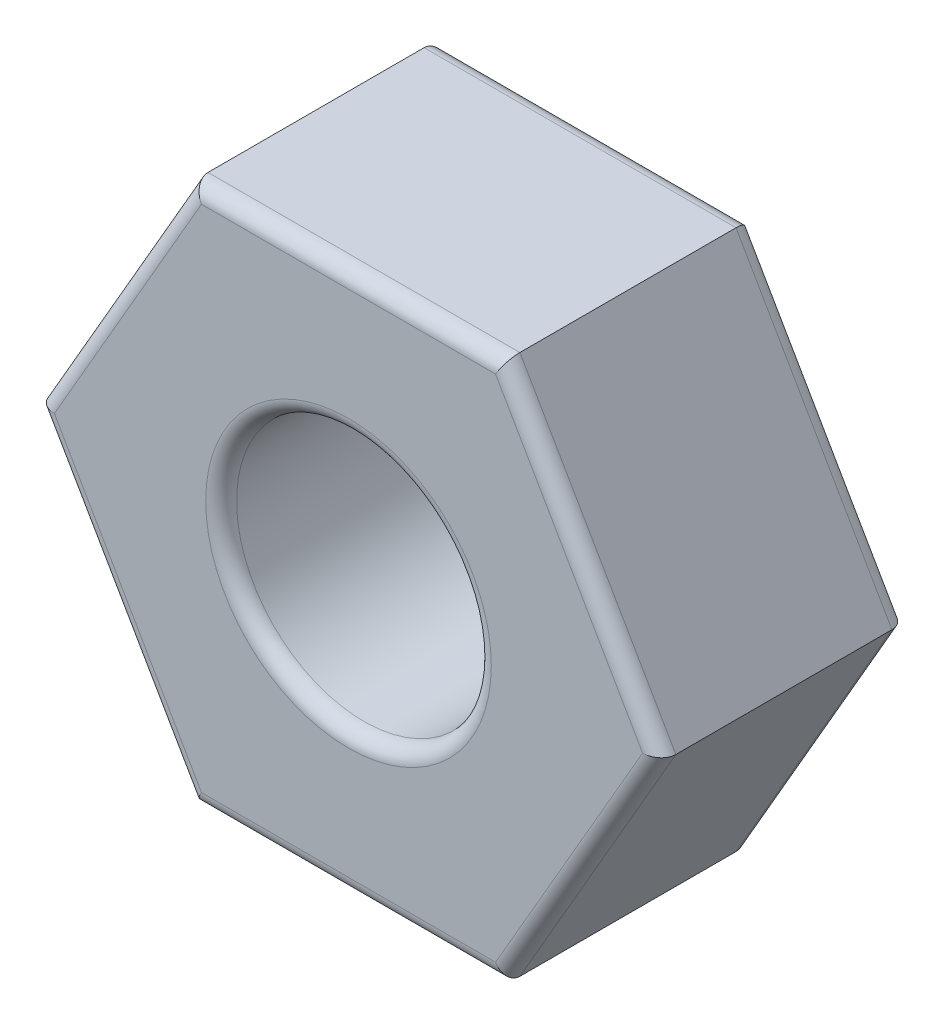
ISO-10303-21;
HEADER;
FILE_DESCRIPTION(('STEP AP214'),'2;1');
FILE_NAME('part.step','',(''),(''),'','','');
FILE_SCHEMA(('AUTOMOTIVE_DESIGN { 1 0 10303 214 1 1 1 1 }'));
ENDSEC;
DATA;
#1=APPLICATION_CONTEXT('core data for automotive mechanical design processes');
#2=APPLICATION_PROTOCOL_DEFINITION('international standard','automotive_design',2000,#1);
#3=PRODUCT_CONTEXT('',#1,'mechanical');
#4=PRODUCT('Part','Part','',(#3));
#5=PRODUCT_RELATED_PRODUCT_CATEGORY('part','',(#4));
#6=PRODUCT_DEFINITION_FORMATION('','',#4);
#7=PRODUCT_DEFINITION_CONTEXT('part definition',#1,'design');
#8=PRODUCT_DEFINITION('design','',#6,#7);
#9=PRODUCT_DEFINITION_SHAPE('','',#8);
#10=(LENGTH_UNIT() NAMED_UNIT(*) SI_UNIT(.MILLI.,.METRE.));
#11=(NAMED_UNIT(*) PLANE_ANGLE_UNIT() SI_UNIT($,.RADIAN.));
#12=(NAMED_UNIT(*) SI_UNIT($,.STERADIAN.) SOLID_ANGLE_UNIT());
#13=UNCERTAINTY_MEASURE_WITH_UNIT(LENGTH_MEASURE(1.E-05),#10,'distance_accuracy_value','');
#14=(GEOMETRIC_REPRESENTATION_CONTEXT(3) GLOBAL_UNCERTAINTY_ASSIGNED_CONTEXT((#13)) GLOBAL_UNIT_ASSIGNED_CONTEXT((#10,
#11,#12)) REPRESENTATION_CONTEXT('',''));
#15=CARTESIAN_POINT('',(0.,0.,0.));
#16=DIRECTION('',(0.,0.,1.));
#17=DIRECTION('',(1.,0.,0.));
#18=AXIS2_PLACEMENT_3D('',#15,#16,#17);
#19=CARTESIAN_POINT('',(0.,0.,3.2));
#20=DIRECTION('',(0.,0.,1.));
#21=DIRECTION('',(1.,0.,0.));
#22=AXIS2_PLACEMENT_3D('',#19,#20,#21);
#23=PLANE('',#22);
#24=CARTESIAN_POINT('',(0.,0.,3.2));
#25=DIRECTION('',(0.,0.,1.));
#26=DIRECTION('',(1.,0.,0.));
#27=AXIS2_PLACEMENT_3D('',#24,#25,#26);
#28=CIRCLE('',#27,1.85);
#29=CARTESIAN_POINT('',(1.85,0.,3.2));
#30=VERTEX_POINT('',#29);
#31=EDGE_CURVE('E11',#30,#30,#28,.F.);
#32=ORIENTED_EDGE('',*,*,#31,.T.);
#33=EDGE_LOOP('',(#32));
#34=FACE_BOUND('',#33,.T.);
#35=DIRECTION('',(0.5,-0.866025403784438,0.));
#36=VECTOR('',#35,1.);
#37=CARTESIAN_POINT('',(-1.8475208614068,-3.4,3.2));
#38=LINE('',#37,#36);
#39=CARTESIAN_POINT('',(-3.81051177665153,0.,3.2));
#40=VERTEX_POINT('',#39);
#41=CARTESIAN_POINT('',(-1.90525588832577,-3.3,3.2));
#42=VERTEX_POINT('',#41);
#43=EDGE_CURVE('E61',#40,#42,#38,.T.);
#44=ORIENTED_EDGE('',*,*,#43,.T.);
#45=DIRECTION('',(1.,0.,0.));
#46=VECTOR('',#45,1.);
#47=CARTESIAN_POINT('',(2.02072594216369,-3.3,3.2));
#48=LINE('',#47,#46);
#49=CARTESIAN_POINT('',(1.90525588832577,-3.3,3.2));
#50=VERTEX_POINT('',#49);
#51=EDGE_CURVE('E53',#42,#50,#48,.T.);
#52=ORIENTED_EDGE('',*,*,#51,.T.);
#53=DIRECTION('',(0.499999999999999,0.866025403784439,0.));
#54=VECTOR('',#53,1.);
#55=CARTESIAN_POINT('',(3.86824680357049,0.100000000000002,3.2));
#56=LINE('',#55,#54);
#57=CARTESIAN_POINT('',(3.81051177665153,0.,3.2));
#58=VERTEX_POINT('',#57);
#59=EDGE_CURVE('E221',#50,#58,#56,.T.);
#60=ORIENTED_EDGE('',*,*,#59,.T.);
#61=DIRECTION('',(-0.5,0.866025403784439,0.));
#62=VECTOR('',#61,1.);
#63=CARTESIAN_POINT('',(1.8475208614068,3.4,3.2));
#64=LINE('',#63,#62);
#65=CARTESIAN_POINT('',(1.90525588832576,3.3,3.2));
#66=VERTEX_POINT('',#65);
#67=EDGE_CURVE('E224',#58,#66,#64,.T.);
#68=ORIENTED_EDGE('',*,*,#67,.T.);
#69=DIRECTION('',(-1.,0.,0.));
#70=VECTOR('',#69,1.);
#71=CARTESIAN_POINT('',(-2.02072594216369,3.3,3.2));
#72=LINE('',#71,#70);
#73=CARTESIAN_POINT('',(-1.90525588832577,3.3,3.2));
#74=VERTEX_POINT('',#73);
#75=EDGE_CURVE('E227',#66,#74,#72,.T.);
#76=ORIENTED_EDGE('',*,*,#75,.T.);
#77=DIRECTION('',(-0.5,-0.866025403784439,0.));
#78=VECTOR('',#77,1.);
#79=CARTESIAN_POINT('',(-3.86824680357049,-0.100000000000002,3.2));
#80=LINE('',#79,#78);
#81=EDGE_CURVE('E66',#74,#40,#80,.T.);
#82=ORIENTED_EDGE('',*,*,#81,.T.);
#83=EDGE_LOOP('',(#44,#52,#60,#68,#76,#82));
#84=FACE_BOUND('',#83,.T.);
#85=ADVANCED_FACE('F43',(#34,#84),#23,.T.);
#86=CARTESIAN_POINT('',(0.,0.,0.));
#87=DIRECTION('',(0.,0.,1.));
#88=DIRECTION('',(1.,0.,0.));
#89=AXIS2_PLACEMENT_3D('',#86,#87,#88);
#90=PLANE('',#89);
#91=CARTESIAN_POINT('',(0.,0.,0.));
#92=DIRECTION('',(0.,0.,1.));
#93=DIRECTION('',(1.,0.,0.));
#94=AXIS2_PLACEMENT_3D('',#91,#92,#93);
#95=CIRCLE('',#94,1.85);
#96=CARTESIAN_POINT('',(1.85,0.,0.));
#97=VERTEX_POINT('',#96);
#98=EDGE_CURVE('E173',#97,#97,#95,.T.);
#99=ORIENTED_EDGE('',*,*,#98,.T.);
#100=EDGE_LOOP('',(#99));
#101=FACE_BOUND('',#100,.T.);
#102=DIRECTION('',(-1.,0.,0.));
#103=VECTOR('',#102,1.);
#104=CARTESIAN_POINT('',(0.,3.3,0.));
#105=LINE('',#104,#103);
#106=CARTESIAN_POINT('',(-1.90525588832577,3.3,0.));
#107=VERTEX_POINT('',#106);
#108=CARTESIAN_POINT('',(1.90525588832576,3.3,0.));
#109=VERTEX_POINT('',#108);
#110=EDGE_CURVE('E171',#107,#109,#105,.F.);
#111=ORIENTED_EDGE('',*,*,#110,.T.);
#112=DIRECTION('',(-0.5,0.866025403784439,0.));
#113=VECTOR('',#112,1.);
#114=CARTESIAN_POINT('',(2.85788383248865,1.65,0.));
#115=LINE('',#114,#113);
#116=CARTESIAN_POINT('',(3.81051177665153,0.,0.));
#117=VERTEX_POINT('',#116);
#118=EDGE_CURVE('E148',#109,#117,#115,.F.);
#119=ORIENTED_EDGE('',*,*,#118,.T.);
#120=DIRECTION('',(0.499999999999999,0.866025403784439,0.));
#121=VECTOR('',#120,1.);
#122=CARTESIAN_POINT('',(2.85788383248865,-1.65,0.));
#123=LINE('',#122,#121);
#124=CARTESIAN_POINT('',(1.90525588832577,-3.3,0.));
#125=VERTEX_POINT('',#124);
#126=EDGE_CURVE('E159',#117,#125,#123,.F.);
#127=ORIENTED_EDGE('',*,*,#126,.T.);
#128=DIRECTION('',(1.,0.,0.));
#129=VECTOR('',#128,1.);
#130=CARTESIAN_POINT('',(0.,-3.3,0.));
#131=LINE('',#130,#129);
#132=CARTESIAN_POINT('',(-1.90525588832577,-3.3,0.));
#133=VERTEX_POINT('',#132);
#134=EDGE_CURVE('E166',#125,#133,#131,.F.);
#135=ORIENTED_EDGE('',*,*,#134,.T.);
#136=DIRECTION('',(0.5,-0.866025403784438,0.));
#137=VECTOR('',#136,1.);
#138=CARTESIAN_POINT('',(-2.85788383248865,-1.65,0.));
#139=LINE('',#138,#137);
#140=CARTESIAN_POINT('',(-3.81051177665153,0.,0.));
#141=VERTEX_POINT('',#140);
#142=EDGE_CURVE('E290',#133,#141,#139,.F.);
#143=ORIENTED_EDGE('',*,*,#142,.T.);
#144=DIRECTION('',(-0.5,-0.866025403784439,0.));
#145=VECTOR('',#144,1.);
#146=CARTESIAN_POINT('',(-2.85788383248865,1.65,0.));
#147=LINE('',#146,#145);
#148=EDGE_CURVE('E179',#141,#107,#147,.F.);
#149=ORIENTED_EDGE('',*,*,#148,.T.);
#150=EDGE_LOOP('',(#111,#119,#127,#135,#143,#149));
#151=FACE_BOUND('',#150,.T.);
#152=ADVANCED_FACE('F169',(#101,#151),#90,.F.);
#153=CARTESIAN_POINT('',(2.02072594216369,-3.5,3.2));
#154=DIRECTION('',(-0.866025403784439,0.499999999999999,0.));
#155=DIRECTION('',(-0.499999999999999,-0.866025403784439,0.));
#156=AXIS2_PLACEMENT_3D('',#153,#154,#155);
#157=PLANE('',#156);
#158=DIRECTION('',(0.,0.,-1.));
#159=VECTOR('',#158,1.);
#160=CARTESIAN_POINT('',(2.02072594216369,-3.5,3.2));
#161=LINE('',#160,#159);
#162=CARTESIAN_POINT('',(2.02072594216369,-3.5,3.));
#163=VERTEX_POINT('',#162);
#164=CARTESIAN_POINT('',(2.02072594216369,-3.5,0.2));
#165=VERTEX_POINT('',#164);
#166=EDGE_CURVE('E244',#163,#165,#161,.T.);
#167=ORIENTED_EDGE('',*,*,#166,.T.);
#168=DIRECTION('',(0.499999999999999,0.866025403784439,0.));
#169=VECTOR('',#168,1.);
#170=CARTESIAN_POINT('',(2.02072594216369,-3.5,0.2));
#171=LINE('',#170,#169);
#172=CARTESIAN_POINT('',(4.04145188432738,0.,0.2));
#173=VERTEX_POINT('',#172);
#174=EDGE_CURVE('E218',#165,#173,#171,.T.);
#175=ORIENTED_EDGE('',*,*,#174,.T.);
#176=DIRECTION('',(0.,0.,-1.));
#177=VECTOR('',#176,1.);
#178=CARTESIAN_POINT('',(4.04145188432738,0.,3.2));
#179=LINE('',#178,#177);
#180=CARTESIAN_POINT('',(4.04145188432738,0.,3.));
#181=VERTEX_POINT('',#180);
#182=EDGE_CURVE('E167',#181,#173,#179,.T.);
#183=ORIENTED_EDGE('',*,*,#182,.F.);
#184=DIRECTION('',(0.499999999999999,0.866025403784439,0.));
#185=VECTOR('',#184,1.);
#186=CARTESIAN_POINT('',(2.02072594216369,-3.5,3.));
#187=LINE('',#186,#185);
#188=EDGE_CURVE('E215',#181,#163,#187,.F.);
#189=ORIENTED_EDGE('',*,*,#188,.T.);
#190=EDGE_LOOP('',(#167,#175,#183,#189));
#191=FACE_BOUND('',#190,.T.);
#192=ADVANCED_FACE('F318',(#191),#157,.F.);
#193=CARTESIAN_POINT('',(4.04145188432738,0.,3.2));
#194=DIRECTION('',(-0.866025403784438,-0.5,0.));
#195=DIRECTION('',(0.5,-0.866025403784439,0.));
#196=AXIS2_PLACEMENT_3D('',#193,#194,#195);
#197=PLANE('',#196);
#198=ORIENTED_EDGE('',*,*,#182,.T.);
#199=DIRECTION('',(-0.5,0.866025403784439,0.));
#200=VECTOR('',#199,1.);
#201=CARTESIAN_POINT('',(4.04145188432738,0.,0.2));
#202=LINE('',#201,#200);
#203=CARTESIAN_POINT('',(2.02072594216369,3.5,0.2));
#204=VERTEX_POINT('',#203);
#205=EDGE_CURVE('E151',#173,#204,#202,.T.);
#206=ORIENTED_EDGE('',*,*,#205,.T.);
#207=DIRECTION('',(0.,0.,-1.));
#208=VECTOR('',#207,1.);
#209=CARTESIAN_POINT('',(2.02072594216369,3.5,3.2));
#210=LINE('',#209,#208);
#211=CARTESIAN_POINT('',(2.02072594216369,3.5,3.));
#212=VERTEX_POINT('',#211);
#213=EDGE_CURVE('E275',#212,#204,#210,.T.);
#214=ORIENTED_EDGE('',*,*,#213,.F.);
#215=DIRECTION('',(-0.5,0.866025403784439,0.));
#216=VECTOR('',#215,1.);
#217=CARTESIAN_POINT('',(4.04145188432738,0.,3.));
#218=LINE('',#217,#216);
#219=EDGE_CURVE('E190',#212,#181,#218,.F.);
#220=ORIENTED_EDGE('',*,*,#219,.T.);
#221=EDGE_LOOP('',(#198,#206,#214,#220));
#222=FACE_BOUND('',#221,.T.);
#223=ADVANCED_FACE('F280',(#222),#197,.F.);
#224=CARTESIAN_POINT('',(2.02072594216369,3.5,3.2));
#225=DIRECTION('',(0.,-1.,0.));
#226=DIRECTION('',(0.,0.,-1.));
#227=AXIS2_PLACEMENT_3D('',#224,#225,#226);
#228=PLANE('',#227);
#229=ORIENTED_EDGE('',*,*,#213,.T.);
#230=DIRECTION('',(-1.,0.,0.));
#231=VECTOR('',#230,1.);
#232=CARTESIAN_POINT('',(2.02072594216369,3.5,0.2));
#233=LINE('',#232,#231);
#234=CARTESIAN_POINT('',(-2.02072594216369,3.5,0.2));
#235=VERTEX_POINT('',#234);
#236=EDGE_CURVE('E197',#204,#235,#233,.T.);
#237=ORIENTED_EDGE('',*,*,#236,.T.);
#238=DIRECTION('',(0.,0.,-1.));
#239=VECTOR('',#238,1.);
#240=CARTESIAN_POINT('',(-2.02072594216369,3.5,3.2));
#241=LINE('',#240,#239);
#242=CARTESIAN_POINT('',(-2.02072594216369,3.5,3.));
#243=VERTEX_POINT('',#242);
#244=EDGE_CURVE('E277',#243,#235,#241,.T.);
#245=ORIENTED_EDGE('',*,*,#244,.F.);
#246=DIRECTION('',(-1.,0.,0.));
#247=VECTOR('',#246,1.);
#248=CARTESIAN_POINT('',(2.02072594216369,3.5,3.));
#249=LINE('',#248,#247);
#250=EDGE_CURVE('E195',#243,#212,#249,.F.);
#251=ORIENTED_EDGE('',*,*,#250,.T.);
#252=EDGE_LOOP('',(#229,#237,#245,#251));
#253=FACE_BOUND('',#252,.T.);
#254=ADVANCED_FACE('F274',(#253),#228,.F.);
#255=CARTESIAN_POINT('',(-2.02072594216369,3.5,3.2));
#256=DIRECTION('',(0.866025403784439,-0.499999999999999,0.));
#257=DIRECTION('',(0.5,0.866025403784439,0.));
#258=AXIS2_PLACEMENT_3D('',#255,#256,#257);
#259=PLANE('',#258);
#260=ORIENTED_EDGE('',*,*,#244,.T.);
#261=DIRECTION('',(-0.5,-0.866025403784439,0.));
#262=VECTOR('',#261,1.);
#263=CARTESIAN_POINT('',(-2.02072594216369,3.5,0.2));
#264=LINE('',#263,#262);
#265=CARTESIAN_POINT('',(-4.04145188432738,0.,0.2));
#266=VERTEX_POINT('',#265);
#267=EDGE_CURVE('E201',#235,#266,#264,.T.);
#268=ORIENTED_EDGE('',*,*,#267,.T.);
#269=DIRECTION('',(0.,0.,-1.));
#270=VECTOR('',#269,1.);
#271=CARTESIAN_POINT('',(-4.04145188432738,0.,3.2));
#272=LINE('',#271,#270);
#273=CARTESIAN_POINT('',(-4.04145188432738,0.,3.));
#274=VERTEX_POINT('',#273);
#275=EDGE_CURVE('E285',#274,#266,#272,.T.);
#276=ORIENTED_EDGE('',*,*,#275,.F.);
#277=DIRECTION('',(-0.5,-0.866025403784439,0.));
#278=VECTOR('',#277,1.);
#279=CARTESIAN_POINT('',(-2.02072594216369,3.5,3.));
#280=LINE('',#279,#278);
#281=EDGE_CURVE('E199',#274,#243,#280,.F.);
#282=ORIENTED_EDGE('',*,*,#281,.T.);
#283=EDGE_LOOP('',(#260,#268,#276,#282));
#284=FACE_BOUND('',#283,.T.);
#285=ADVANCED_FACE('F304',(#284),#259,.F.);
#286=CARTESIAN_POINT('',(-4.04145188432738,0.,3.2));
#287=DIRECTION('',(0.866025403784438,0.5,0.));
#288=DIRECTION('',(-0.5,0.866025403784438,0.));
#289=AXIS2_PLACEMENT_3D('',#286,#287,#288);
#290=PLANE('',#289);
#291=ORIENTED_EDGE('',*,*,#275,.T.);
#292=DIRECTION('',(0.5,-0.866025403784438,0.));
#293=VECTOR('',#292,1.);
#294=CARTESIAN_POINT('',(-4.04145188432738,0.,0.2));
#295=LINE('',#294,#293);
#296=CARTESIAN_POINT('',(-2.02072594216369,-3.5,0.2));
#297=VERTEX_POINT('',#296);
#298=EDGE_CURVE('E206',#266,#297,#295,.T.);
#299=ORIENTED_EDGE('',*,*,#298,.T.);
#300=DIRECTION('',(0.,0.,-1.));
#301=VECTOR('',#300,1.);
#302=CARTESIAN_POINT('',(-2.02072594216369,-3.5,3.2));
#303=LINE('',#302,#301);
#304=CARTESIAN_POINT('',(-2.02072594216369,-3.5,3.));
#305=VERTEX_POINT('',#304);
#306=EDGE_CURVE('E310',#305,#297,#303,.T.);
#307=ORIENTED_EDGE('',*,*,#306,.F.);
#308=DIRECTION('',(0.5,-0.866025403784438,0.));
#309=VECTOR('',#308,1.);
#310=CARTESIAN_POINT('',(-4.04145188432738,0.,3.));
#311=LINE('',#310,#309);
#312=EDGE_CURVE('E204',#305,#274,#311,.F.);
#313=ORIENTED_EDGE('',*,*,#312,.T.);
#314=EDGE_LOOP('',(#291,#299,#307,#313));
#315=FACE_BOUND('',#314,.T.);
#316=ADVANCED_FACE('F329',(#315),#290,.F.);
#317=CARTESIAN_POINT('',(-2.02072594216369,-3.5,3.2));
#318=DIRECTION('',(0.,1.,0.));
#319=DIRECTION('',(-1.,0.,0.));
#320=AXIS2_PLACEMENT_3D('',#317,#318,#319);
#321=PLANE('',#320);
#322=ORIENTED_EDGE('',*,*,#306,.T.);
#323=DIRECTION('',(1.,0.,0.));
#324=VECTOR('',#323,1.);
#325=CARTESIAN_POINT('',(-2.02072594216369,-3.5,0.2));
#326=LINE('',#325,#324);
#327=EDGE_CURVE('E213',#297,#165,#326,.T.);
#328=ORIENTED_EDGE('',*,*,#327,.T.);
#329=ORIENTED_EDGE('',*,*,#166,.F.);
#330=DIRECTION('',(1.,0.,0.));
#331=VECTOR('',#330,1.);
#332=CARTESIAN_POINT('',(-2.02072594216369,-3.5,3.));
#333=LINE('',#332,#331);
#334=EDGE_CURVE('E209',#163,#305,#333,.F.);
#335=ORIENTED_EDGE('',*,*,#334,.T.);
#336=EDGE_LOOP('',(#322,#328,#329,#335));
#337=FACE_BOUND('',#336,.T.);
#338=ADVANCED_FACE('F330',(#337),#321,.F.);
#339=CARTESIAN_POINT('',(0.,0.,3.2));
#340=DIRECTION('',(0.,0.,-1.));
#341=DIRECTION('',(-1.,0.,0.));
#342=AXIS2_PLACEMENT_3D('',#339,#340,#341);
#343=CYLINDRICAL_SURFACE('',#342,1.65);
#344=CARTESIAN_POINT('',(0.,0.,0.2));
#345=DIRECTION('',(0.,0.,1.));
#346=DIRECTION('',(1.,0.,0.));
#347=AXIS2_PLACEMENT_3D('',#344,#345,#346);
#348=CIRCLE('',#347,1.65);
#349=CARTESIAN_POINT('',(1.65,0.,0.2));
#350=VERTEX_POINT('',#349);
#351=EDGE_CURVE('E186',#350,#350,#348,.F.);
#352=ORIENTED_EDGE('',*,*,#351,.T.);
#353=EDGE_LOOP('',(#352));
#354=FACE_BOUND('',#353,.T.);
#355=CARTESIAN_POINT('',(0.,0.,3.));
#356=DIRECTION('',(0.,0.,1.));
#357=DIRECTION('',(1.,0.,0.));
#358=AXIS2_PLACEMENT_3D('',#355,#356,#357);
#359=CIRCLE('',#358,1.65);
#360=CARTESIAN_POINT('',(1.65,0.,3.));
#361=VERTEX_POINT('',#360);
#362=EDGE_CURVE('E177',#361,#361,#359,.T.);
#363=ORIENTED_EDGE('',*,*,#362,.T.);
#364=EDGE_LOOP('',(#363));
#365=FACE_BOUND('',#364,.T.);
#366=ADVANCED_FACE('F349',(#354,#365),#343,.F.);
#367=CARTESIAN_POINT('',(0.,0.,0.2));
#368=DIRECTION('',(0.,0.,1.));
#369=DIRECTION('',(1.,0.,0.));
#370=AXIS2_PLACEMENT_3D('',#367,#368,#369);
#371=TOROIDAL_SURFACE('',#370,1.85,0.2);
#372=ORIENTED_EDGE('',*,*,#351,.F.);
#373=EDGE_LOOP('',(#372));
#374=FACE_BOUND('',#373,.T.);
#375=ORIENTED_EDGE('',*,*,#98,.F.);
#376=EDGE_LOOP('',(#375));
#377=FACE_BOUND('',#376,.T.);
#378=ADVANCED_FACE('F363',(#374,#377),#371,.T.);
#379=CARTESIAN_POINT('',(-3.86824680357049,0.0999999999999983,0.2));
#380=DIRECTION('',(0.5,-0.866025403784438,0.));
#381=DIRECTION('',(0.866025403784438,0.5,0.));
#382=AXIS2_PLACEMENT_3D('',#379,#380,#381);
#383=CYLINDRICAL_SURFACE('',#382,0.2);
#384=CARTESIAN_POINT('',(-3.81051177665153,0.,0.2));
#385=DIRECTION('',(0.,-1.,0.));
#386=DIRECTION('',(1.,0.,0.));
#387=AXIS2_PLACEMENT_3D('',#384,#385,#386);
#388=ELLIPSE('',#387,0.23094010767585,0.2);
#389=EDGE_CURVE('E237',#141,#266,#388,.F.);
#390=ORIENTED_EDGE('',*,*,#389,.F.);
#391=ORIENTED_EDGE('',*,*,#142,.F.);
#392=CARTESIAN_POINT('',(-1.90525588832577,-3.3,0.2));
#393=DIRECTION('',(0.866025403784439,-0.5,0.));
#394=DIRECTION('',(0.5,0.866025403784439,0.));
#395=AXIS2_PLACEMENT_3D('',#392,#393,#394);
#396=ELLIPSE('',#395,0.23094010767585,0.2);
#397=EDGE_CURVE('E241',#297,#133,#396,.T.);
#398=ORIENTED_EDGE('',*,*,#397,.F.);
#399=ORIENTED_EDGE('',*,*,#298,.F.);
#400=EDGE_LOOP('',(#390,#391,#398,#399));
#401=FACE_BOUND('',#400,.T.);
#402=ADVANCED_FACE('F327',(#401),#383,.T.);
#403=CARTESIAN_POINT('',(-2.02072594216369,-3.3,0.2));
#404=DIRECTION('',(1.,0.,0.));
#405=DIRECTION('',(0.,1.,0.));
#406=AXIS2_PLACEMENT_3D('',#403,#404,#405);
#407=CYLINDRICAL_SURFACE('',#406,0.2);
#408=ORIENTED_EDGE('',*,*,#397,.T.);
#409=ORIENTED_EDGE('',*,*,#134,.F.);
#410=CARTESIAN_POINT('',(1.90525588832577,-3.3,0.2));
#411=DIRECTION('',(0.866025403784438,0.5,0.));
#412=DIRECTION('',(-0.5,0.866025403784438,0.));
#413=AXIS2_PLACEMENT_3D('',#410,#411,#412);
#414=ELLIPSE('',#413,0.23094010767585,0.2);
#415=EDGE_CURVE('E162',#165,#125,#414,.T.);
#416=ORIENTED_EDGE('',*,*,#415,.F.);
#417=ORIENTED_EDGE('',*,*,#327,.F.);
#418=EDGE_LOOP('',(#408,#409,#416,#417));
#419=FACE_BOUND('',#418,.T.);
#420=ADVANCED_FACE('F324',(#419),#407,.T.);
#421=CARTESIAN_POINT('',(-1.84752086140681,3.4,0.2));
#422=DIRECTION('',(-0.5,-0.866025403784439,0.));
#423=DIRECTION('',(0.866025403784439,-0.499999999999999,0.));
#424=AXIS2_PLACEMENT_3D('',#421,#422,#423);
#425=CYLINDRICAL_SURFACE('',#424,0.2);
#426=ORIENTED_EDGE('',*,*,#389,.T.);
#427=ORIENTED_EDGE('',*,*,#267,.F.);
#428=CARTESIAN_POINT('',(-1.90525588832577,3.3,0.2));
#429=DIRECTION('',(-0.866025403784438,-0.5,0.));
#430=DIRECTION('',(0.5,-0.866025403784439,0.));
#431=AXIS2_PLACEMENT_3D('',#428,#429,#430);
#432=ELLIPSE('',#431,0.23094010767585,0.2);
#433=EDGE_CURVE('E155',#107,#235,#432,.F.);
#434=ORIENTED_EDGE('',*,*,#433,.F.);
#435=ORIENTED_EDGE('',*,*,#148,.F.);
#436=EDGE_LOOP('',(#426,#427,#434,#435));
#437=FACE_BOUND('',#436,.T.);
#438=ADVANCED_FACE('F299',(#437),#425,.T.);
#439=CARTESIAN_POINT('',(1.8475208614068,-3.4,0.2));
#440=DIRECTION('',(0.499999999999999,0.866025403784439,0.));
#441=DIRECTION('',(-0.866025403784439,0.499999999999999,0.));
#442=AXIS2_PLACEMENT_3D('',#439,#440,#441);
#443=CYLINDRICAL_SURFACE('',#442,0.2);
#444=ORIENTED_EDGE('',*,*,#415,.T.);
#445=ORIENTED_EDGE('',*,*,#126,.F.);
#446=CARTESIAN_POINT('',(3.81051177665153,0.,0.2));
#447=DIRECTION('',(0.,1.,0.));
#448=DIRECTION('',(1.,0.,0.));
#449=AXIS2_PLACEMENT_3D('',#446,#447,#448);
#450=ELLIPSE('',#449,0.23094010767585,0.2);
#451=EDGE_CURVE('E144',#173,#117,#450,.T.);
#452=ORIENTED_EDGE('',*,*,#451,.F.);
#453=ORIENTED_EDGE('',*,*,#174,.F.);
#454=EDGE_LOOP('',(#444,#445,#452,#453));
#455=FACE_BOUND('',#454,.T.);
#456=ADVANCED_FACE('F160',(#455),#443,.T.);
#457=CARTESIAN_POINT('',(2.02072594216369,3.3,0.2));
#458=DIRECTION('',(-1.,0.,0.));
#459=DIRECTION('',(0.,0.,1.));
#460=AXIS2_PLACEMENT_3D('',#457,#458,#459);
#461=CYLINDRICAL_SURFACE('',#460,0.2);
#462=ORIENTED_EDGE('',*,*,#433,.T.);
#463=ORIENTED_EDGE('',*,*,#236,.F.);
#464=CARTESIAN_POINT('',(1.90525588832576,3.3,0.2));
#465=DIRECTION('',(-0.866025403784439,0.5,0.));
#466=DIRECTION('',(-0.5,-0.866025403784439,0.));
#467=AXIS2_PLACEMENT_3D('',#464,#465,#466);
#468=ELLIPSE('',#467,0.23094010767585,0.2);
#469=EDGE_CURVE('E156',#109,#204,#468,.F.);
#470=ORIENTED_EDGE('',*,*,#469,.F.);
#471=ORIENTED_EDGE('',*,*,#110,.F.);
#472=EDGE_LOOP('',(#462,#463,#470,#471));
#473=FACE_BOUND('',#472,.T.);
#474=ADVANCED_FACE('F302',(#473),#461,.T.);
#475=CARTESIAN_POINT('',(3.86824680357049,-0.099999999999998,0.2));
#476=DIRECTION('',(-0.5,0.866025403784439,0.));
#477=DIRECTION('',(-0.866025403784438,-0.5,0.));
#478=AXIS2_PLACEMENT_3D('',#475,#476,#477);
#479=CYLINDRICAL_SURFACE('',#478,0.2);
#480=ORIENTED_EDGE('',*,*,#451,.T.);
#481=ORIENTED_EDGE('',*,*,#118,.F.);
#482=ORIENTED_EDGE('',*,*,#469,.T.);
#483=ORIENTED_EDGE('',*,*,#205,.F.);
#484=EDGE_LOOP('',(#480,#481,#482,#483));
#485=FACE_BOUND('',#484,.T.);
#486=ADVANCED_FACE('F146',(#485),#479,.T.);
#487=CARTESIAN_POINT('',(0.,0.,3.));
#488=DIRECTION('',(0.,0.,1.));
#489=DIRECTION('',(1.,0.,0.));
#490=AXIS2_PLACEMENT_3D('',#487,#488,#489);
#491=TOROIDAL_SURFACE('',#490,1.85,0.2);
#492=ORIENTED_EDGE('',*,*,#31,.F.);
#493=EDGE_LOOP('',(#492));
#494=FACE_BOUND('',#493,.T.);
#495=ORIENTED_EDGE('',*,*,#362,.F.);
#496=EDGE_LOOP('',(#495));
#497=FACE_BOUND('',#496,.T.);
#498=ADVANCED_FACE('F369',(#494,#497),#491,.T.);
#499=CARTESIAN_POINT('',(0.,3.3,3.));
#500=DIRECTION('',(1.,0.,0.));
#501=DIRECTION('',(0.,0.,-1.));
#502=AXIS2_PLACEMENT_3D('',#499,#500,#501);
#503=CYLINDRICAL_SURFACE('',#502,0.2);
#504=CARTESIAN_POINT('',(1.90525588832576,3.3,3.));
#505=DIRECTION('',(0.866025403784439,-0.5,0.));
#506=DIRECTION('',(-0.5,-0.866025403784439,0.));
#507=AXIS2_PLACEMENT_3D('',#504,#505,#506);
#508=ELLIPSE('',#507,0.23094010767585,0.2);
#509=EDGE_CURVE('E256',#212,#66,#508,.T.);
#510=ORIENTED_EDGE('',*,*,#509,.F.);
#511=ORIENTED_EDGE('',*,*,#250,.F.);
#512=CARTESIAN_POINT('',(-1.90525588832577,3.3,3.));
#513=DIRECTION('',(0.866025403784438,0.5,0.));
#514=DIRECTION('',(0.5,-0.866025403784439,0.));
#515=AXIS2_PLACEMENT_3D('',#512,#513,#514);
#516=ELLIPSE('',#515,0.23094010767585,0.2);
#517=EDGE_CURVE('E47',#74,#243,#516,.F.);
#518=ORIENTED_EDGE('',*,*,#517,.F.);
#519=ORIENTED_EDGE('',*,*,#75,.F.);
#520=EDGE_LOOP('',(#510,#511,#518,#519));
#521=FACE_BOUND('',#520,.T.);
#522=ADVANCED_FACE('F45',(#521),#503,.T.);
#523=CARTESIAN_POINT('',(-2.85788383248865,1.65,3.));
#524=DIRECTION('',(0.5,0.866025403784439,0.));
#525=DIRECTION('',(-0.866025403784439,0.499999999999999,0.));
#526=AXIS2_PLACEMENT_3D('',#523,#524,#525);
#527=CYLINDRICAL_SURFACE('',#526,0.2);
#528=ORIENTED_EDGE('',*,*,#517,.T.);
#529=ORIENTED_EDGE('',*,*,#281,.F.);
#530=CARTESIAN_POINT('',(-3.81051177665153,0.,3.));
#531=DIRECTION('',(0.,1.,0.));
#532=DIRECTION('',(1.,0.,0.));
#533=AXIS2_PLACEMENT_3D('',#530,#531,#532);
#534=ELLIPSE('',#533,0.23094010767585,0.2);
#535=EDGE_CURVE('E254',#40,#274,#534,.F.);
#536=ORIENTED_EDGE('',*,*,#535,.F.);
#537=ORIENTED_EDGE('',*,*,#81,.F.);
#538=EDGE_LOOP('',(#528,#529,#536,#537));
#539=FACE_BOUND('',#538,.T.);
#540=ADVANCED_FACE('F266',(#539),#527,.T.);
#541=CARTESIAN_POINT('',(2.85788383248865,1.65,3.));
#542=DIRECTION('',(0.5,-0.866025403784439,0.));
#543=DIRECTION('',(0.866025403784438,0.5,0.));
#544=AXIS2_PLACEMENT_3D('',#541,#542,#543);
#545=CYLINDRICAL_SURFACE('',#544,0.2);
#546=ORIENTED_EDGE('',*,*,#509,.T.);
#547=ORIENTED_EDGE('',*,*,#67,.F.);
#548=CARTESIAN_POINT('',(3.81051177665153,0.,3.));
#549=DIRECTION('',(0.,-1.,0.));
#550=DIRECTION('',(-1.,0.,0.));
#551=AXIS2_PLACEMENT_3D('',#548,#549,#550);
#552=ELLIPSE('',#551,0.23094010767585,0.2);
#553=EDGE_CURVE('E250',#181,#58,#552,.T.);
#554=ORIENTED_EDGE('',*,*,#553,.F.);
#555=ORIENTED_EDGE('',*,*,#219,.F.);
#556=EDGE_LOOP('',(#546,#547,#554,#555));
#557=FACE_BOUND('',#556,.T.);
#558=ADVANCED_FACE('F390',(#557),#545,.T.);
#559=CARTESIAN_POINT('',(-2.85788383248865,-1.65,3.));
#560=DIRECTION('',(-0.5,0.866025403784438,0.));
#561=DIRECTION('',(-0.866025403784438,-0.5,0.));
#562=AXIS2_PLACEMENT_3D('',#559,#560,#561);
#563=CYLINDRICAL_SURFACE('',#562,0.2);
#564=ORIENTED_EDGE('',*,*,#535,.T.);
#565=ORIENTED_EDGE('',*,*,#312,.F.);
#566=CARTESIAN_POINT('',(-1.90525588832577,-3.3,3.));
#567=DIRECTION('',(-0.866025403784439,0.5,0.));
#568=DIRECTION('',(0.5,0.866025403784439,0.));
#569=AXIS2_PLACEMENT_3D('',#566,#567,#568);
#570=ELLIPSE('',#569,0.23094010767585,0.2);
#571=EDGE_CURVE('E248',#42,#305,#570,.F.);
#572=ORIENTED_EDGE('',*,*,#571,.F.);
#573=ORIENTED_EDGE('',*,*,#43,.F.);
#574=EDGE_LOOP('',(#564,#565,#572,#573));
#575=FACE_BOUND('',#574,.T.);
#576=ADVANCED_FACE('F387',(#575),#563,.T.);
#577=CARTESIAN_POINT('',(2.85788383248865,-1.65,3.));
#578=DIRECTION('',(-0.499999999999999,-0.866025403784439,0.));
#579=DIRECTION('',(0.866025403784439,-0.499999999999999,0.));
#580=AXIS2_PLACEMENT_3D('',#577,#578,#579);
#581=CYLINDRICAL_SURFACE('',#580,0.2);
#582=ORIENTED_EDGE('',*,*,#553,.T.);
#583=ORIENTED_EDGE('',*,*,#59,.F.);
#584=CARTESIAN_POINT('',(1.90525588832577,-3.3,3.));
#585=DIRECTION('',(-0.866025403784438,-0.5,0.));
#586=DIRECTION('',(0.5,-0.866025403784438,0.));
#587=AXIS2_PLACEMENT_3D('',#584,#585,#586);
#588=ELLIPSE('',#587,0.23094010767585,0.2);
#589=EDGE_CURVE('E245',#163,#50,#588,.T.);
#590=ORIENTED_EDGE('',*,*,#589,.F.);
#591=ORIENTED_EDGE('',*,*,#188,.F.);
#592=EDGE_LOOP('',(#582,#583,#590,#591));
#593=FACE_BOUND('',#592,.T.);
#594=ADVANCED_FACE('F338',(#593),#581,.T.);
#595=CARTESIAN_POINT('',(0.,-3.3,3.));
#596=DIRECTION('',(-1.,0.,0.));
#597=DIRECTION('',(0.,-1.,0.));
#598=AXIS2_PLACEMENT_3D('',#595,#596,#597);
#599=CYLINDRICAL_SURFACE('',#598,0.2);
#600=ORIENTED_EDGE('',*,*,#571,.T.);
#601=ORIENTED_EDGE('',*,*,#334,.F.);
#602=ORIENTED_EDGE('',*,*,#589,.T.);
#603=ORIENTED_EDGE('',*,*,#51,.F.);
#604=EDGE_LOOP('',(#600,#601,#602,#603));
#605=FACE_BOUND('',#604,.T.);
#606=ADVANCED_FACE('F333',(#605),#599,.T.);
#607=CLOSED_SHELL('',(#85,#152,#192,#223,#254,#285,#316,#338,#366,#378,#402,#420,#438,#456,#474,
#486,#498,#522,#540,#558,#576,#594,#606));
#608=MANIFOLD_SOLID_BREP('B2',#607);
#609=ADVANCED_BREP_SHAPE_REPRESENTATION('',(#18,#608),#14);
#610=SHAPE_DEFINITION_REPRESENTATION(#9,#609);
ENDSEC;
END-ISO-10303-21;
